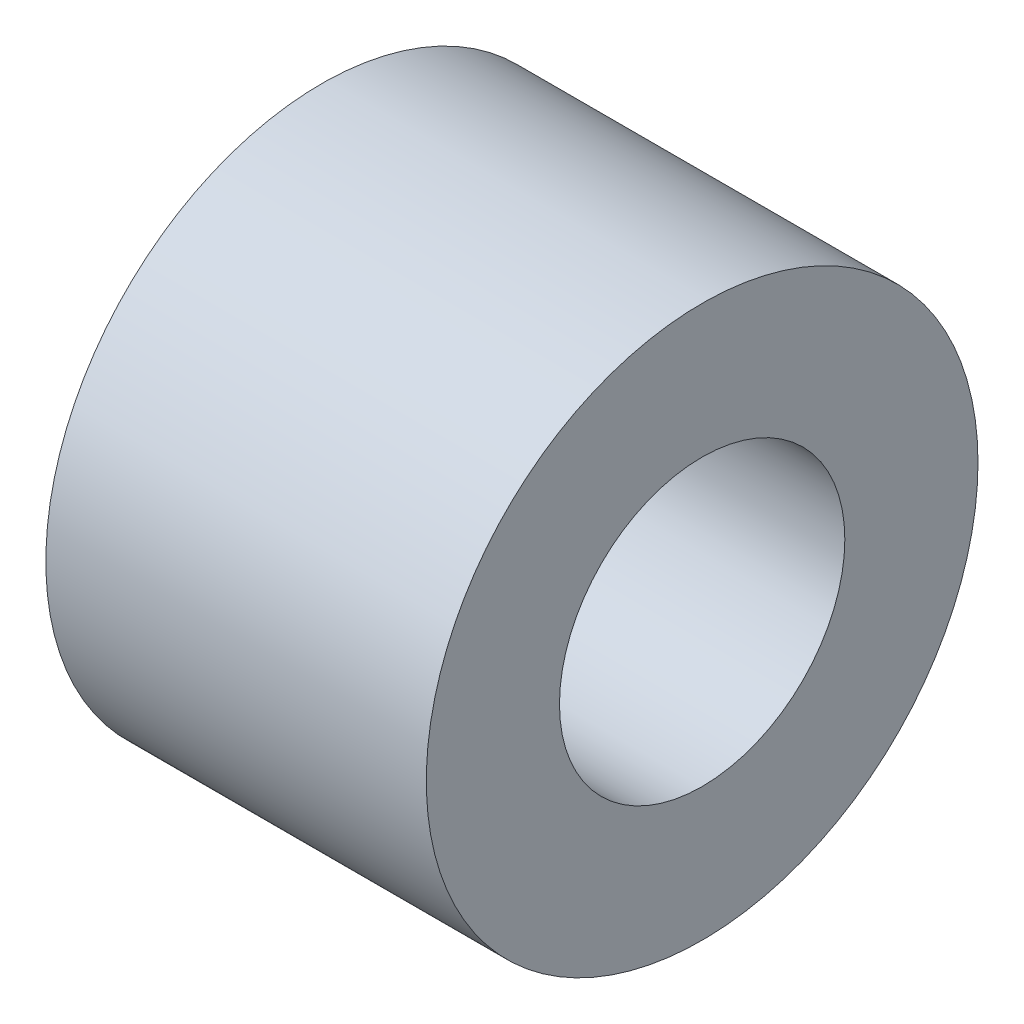
ISO-10303-21;
HEADER;
FILE_DESCRIPTION(('STEP AP214'),'2;1');
FILE_NAME('part.step','',(''),(''),'','','');
FILE_SCHEMA(('AUTOMOTIVE_DESIGN { 1 0 10303 214 1 1 1 1 }'));
ENDSEC;
DATA;
#1=APPLICATION_CONTEXT('core data for automotive mechanical design processes');
#2=APPLICATION_PROTOCOL_DEFINITION('international standard','automotive_design',2000,#1);
#3=PRODUCT_CONTEXT('',#1,'mechanical');
#4=PRODUCT('Part','Part','',(#3));
#5=PRODUCT_RELATED_PRODUCT_CATEGORY('part','',(#4));
#6=PRODUCT_DEFINITION_FORMATION('','',#4);
#7=PRODUCT_DEFINITION_CONTEXT('part definition',#1,'design');
#8=PRODUCT_DEFINITION('design','',#6,#7);
#9=PRODUCT_DEFINITION_SHAPE('','',#8);
#10=(LENGTH_UNIT() NAMED_UNIT(*) SI_UNIT(.MILLI.,.METRE.));
#11=(NAMED_UNIT(*) PLANE_ANGLE_UNIT() SI_UNIT($,.RADIAN.));
#12=(NAMED_UNIT(*) SI_UNIT($,.STERADIAN.) SOLID_ANGLE_UNIT());
#13=UNCERTAINTY_MEASURE_WITH_UNIT(LENGTH_MEASURE(1.E-05),#10,'distance_accuracy_value','');
#14=(GEOMETRIC_REPRESENTATION_CONTEXT(3) GLOBAL_UNCERTAINTY_ASSIGNED_CONTEXT((#13)) GLOBAL_UNIT_ASSIGNED_CONTEXT((#10,
#11,#12)) REPRESENTATION_CONTEXT('',''));
#15=CARTESIAN_POINT('',(0.,0.,0.));
#16=DIRECTION('',(0.,0.,1.));
#17=DIRECTION('',(1.,0.,0.));
#18=AXIS2_PLACEMENT_3D('',#15,#16,#17);
#19=CARTESIAN_POINT('',(4.,0.,0.));
#20=DIRECTION('',(1.,0.,0.));
#21=DIRECTION('',(0.,0.,-1.));
#22=AXIS2_PLACEMENT_3D('',#19,#20,#21);
#23=PLANE('',#22);
#24=CARTESIAN_POINT('',(4.,0.,0.));
#25=DIRECTION('',(1.,0.,0.));
#26=DIRECTION('',(0.,0.,-1.));
#27=AXIS2_PLACEMENT_3D('',#24,#25,#26);
#28=CIRCLE('',#27,2.9);
#29=CARTESIAN_POINT('',(4.,0.,-2.9));
#30=VERTEX_POINT('',#29);
#31=EDGE_CURVE('E10',#30,#30,#28,.T.);
#32=ORIENTED_EDGE('',*,*,#31,.T.);
#33=EDGE_LOOP('',(#32));
#34=FACE_BOUND('',#33,.T.);
#35=CARTESIAN_POINT('',(4.,0.,0.));
#36=DIRECTION('',(1.,0.,0.));
#37=DIRECTION('',(0.,0.,-1.));
#38=AXIS2_PLACEMENT_3D('',#35,#36,#37);
#39=CIRCLE('',#38,1.5);
#40=CARTESIAN_POINT('',(4.,0.,-1.5));
#41=VERTEX_POINT('',#40);
#42=EDGE_CURVE('E35',#41,#41,#39,.T.);
#43=ORIENTED_EDGE('',*,*,#42,.F.);
#44=EDGE_LOOP('',(#43));
#45=FACE_BOUND('',#44,.T.);
#46=ADVANCED_FACE('F24',(#34,#45),#23,.T.);
#47=CARTESIAN_POINT('',(0.,0.,0.));
#48=DIRECTION('',(1.,0.,0.));
#49=DIRECTION('',(0.,0.,-1.));
#50=AXIS2_PLACEMENT_3D('',#47,#48,#49);
#51=PLANE('',#50);
#52=CARTESIAN_POINT('',(0.,0.,0.));
#53=DIRECTION('',(1.,0.,0.));
#54=DIRECTION('',(0.,0.,-1.));
#55=AXIS2_PLACEMENT_3D('',#52,#53,#54);
#56=CIRCLE('',#55,2.9);
#57=CARTESIAN_POINT('',(0.,0.,-2.9));
#58=VERTEX_POINT('',#57);
#59=EDGE_CURVE('E31',#58,#58,#56,.T.);
#60=ORIENTED_EDGE('',*,*,#59,.F.);
#61=EDGE_LOOP('',(#60));
#62=FACE_BOUND('',#61,.T.);
#63=CARTESIAN_POINT('',(0.,0.,0.));
#64=DIRECTION('',(1.,0.,0.));
#65=DIRECTION('',(0.,0.,-1.));
#66=AXIS2_PLACEMENT_3D('',#63,#64,#65);
#67=CIRCLE('',#66,1.5);
#68=CARTESIAN_POINT('',(0.,0.,-1.5));
#69=VERTEX_POINT('',#68);
#70=EDGE_CURVE('E39',#69,#69,#67,.T.);
#71=ORIENTED_EDGE('',*,*,#70,.T.);
#72=EDGE_LOOP('',(#71));
#73=FACE_BOUND('',#72,.T.);
#74=ADVANCED_FACE('F45',(#62,#73),#51,.F.);
#75=CARTESIAN_POINT('',(4.,0.,0.));
#76=DIRECTION('',(-1.,0.,0.));
#77=DIRECTION('',(0.,0.,1.));
#78=AXIS2_PLACEMENT_3D('',#75,#76,#77);
#79=CYLINDRICAL_SURFACE('',#78,2.9);
#80=ORIENTED_EDGE('',*,*,#31,.F.);
#81=EDGE_LOOP('',(#80));
#82=FACE_BOUND('',#81,.T.);
#83=ORIENTED_EDGE('',*,*,#59,.T.);
#84=EDGE_LOOP('',(#83));
#85=FACE_BOUND('',#84,.T.);
#86=ADVANCED_FACE('F26',(#82,#85),#79,.T.);
#87=CARTESIAN_POINT('',(4.,0.,0.));
#88=DIRECTION('',(-1.,0.,0.));
#89=DIRECTION('',(0.,0.,1.));
#90=AXIS2_PLACEMENT_3D('',#87,#88,#89);
#91=CYLINDRICAL_SURFACE('',#90,1.5);
#92=ORIENTED_EDGE('',*,*,#42,.T.);
#93=EDGE_LOOP('',(#92));
#94=FACE_BOUND('',#93,.T.);
#95=ORIENTED_EDGE('',*,*,#70,.F.);
#96=EDGE_LOOP('',(#95));
#97=FACE_BOUND('',#96,.T.);
#98=ADVANCED_FACE('F47',(#94,#97),#91,.F.);
#99=CLOSED_SHELL('',(#46,#74,#86,#98));
#100=MANIFOLD_SOLID_BREP('B2',#99);
#101=ADVANCED_BREP_SHAPE_REPRESENTATION('',(#18,#100),#14);
#102=SHAPE_DEFINITION_REPRESENTATION(#9,#101);
ENDSEC;
END-ISO-10303-21;
